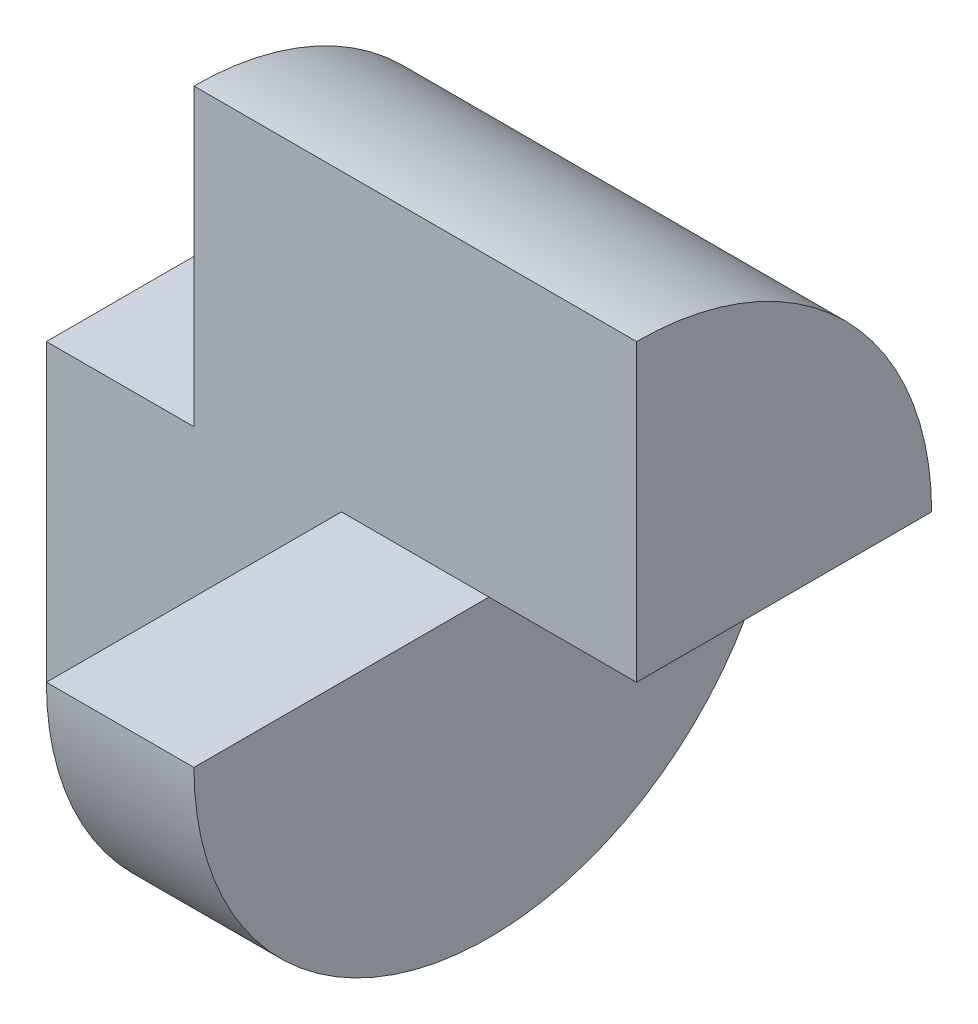
ISO-10303-21;
HEADER;
FILE_DESCRIPTION(('STEP AP214'),'2;1');
FILE_NAME('part.step','',(''),(''),'','','');
FILE_SCHEMA(('AUTOMOTIVE_DESIGN { 1 0 10303 214 1 1 1 1 }'));
ENDSEC;
DATA;
#1=APPLICATION_CONTEXT('core data for automotive mechanical design processes');
#2=APPLICATION_PROTOCOL_DEFINITION('international standard','automotive_design',2000,#1);
#3=PRODUCT_CONTEXT('',#1,'mechanical');
#4=PRODUCT('Part','Part','',(#3));
#5=PRODUCT_RELATED_PRODUCT_CATEGORY('part','',(#4));
#6=PRODUCT_DEFINITION_FORMATION('','',#4);
#7=PRODUCT_DEFINITION_CONTEXT('part definition',#1,'design');
#8=PRODUCT_DEFINITION('design','',#6,#7);
#9=PRODUCT_DEFINITION_SHAPE('','',#8);
#10=(LENGTH_UNIT() NAMED_UNIT(*) SI_UNIT(.MILLI.,.METRE.));
#11=(NAMED_UNIT(*) PLANE_ANGLE_UNIT() SI_UNIT($,.RADIAN.));
#12=(NAMED_UNIT(*) SI_UNIT($,.STERADIAN.) SOLID_ANGLE_UNIT());
#13=UNCERTAINTY_MEASURE_WITH_UNIT(LENGTH_MEASURE(1.E-05),#10,'distance_accuracy_value','');
#14=(GEOMETRIC_REPRESENTATION_CONTEXT(3) GLOBAL_UNCERTAINTY_ASSIGNED_CONTEXT((#13)) GLOBAL_UNIT_ASSIGNED_CONTEXT((#10,
#11,#12)) REPRESENTATION_CONTEXT('',''));
#15=CARTESIAN_POINT('',(0.,0.,0.));
#16=DIRECTION('',(0.,0.,1.));
#17=DIRECTION('',(1.,0.,0.));
#18=AXIS2_PLACEMENT_3D('',#15,#16,#17);
#19=CARTESIAN_POINT('',(0.,19.9999999999996,0.));
#20=DIRECTION('',(0.,-1.,0.));
#21=DIRECTION('',(0.,0.,-1.));
#22=AXIS2_PLACEMENT_3D('',#19,#20,#21);
#23=PLANE('',#22);
#24=DIRECTION('',(0.,0.,1.));
#25=VECTOR('',#24,1.);
#26=CARTESIAN_POINT('',(0.,19.9999999999996,0.));
#27=LINE('',#26,#25);
#28=CARTESIAN_POINT('',(0.,19.9999999999996,0.));
#29=VERTEX_POINT('',#28);
#30=CARTESIAN_POINT('',(0.,19.9999999999996,20.));
#31=VERTEX_POINT('',#30);
#32=EDGE_CURVE('E149',#29,#31,#27,.T.);
#33=ORIENTED_EDGE('',*,*,#32,.T.);
#34=DIRECTION('',(-1.,0.,0.));
#35=VECTOR('',#34,1.);
#36=CARTESIAN_POINT('',(20.,19.9999999999996,20.));
#37=LINE('',#36,#35);
#38=CARTESIAN_POINT('',(10.,19.9999999999996,20.));
#39=VERTEX_POINT('',#38);
#40=EDGE_CURVE('E157',#39,#31,#37,.T.);
#41=ORIENTED_EDGE('',*,*,#40,.F.);
#42=DIRECTION('',(0.,0.,1.));
#43=VECTOR('',#42,1.);
#44=CARTESIAN_POINT('',(10.,19.9999999999996,0.));
#45=LINE('',#44,#43);
#46=CARTESIAN_POINT('',(10.,19.9999999999996,-4.26741975090295E-13));
#47=VERTEX_POINT('',#46);
#48=EDGE_CURVE('E59',#47,#39,#45,.T.);
#49=ORIENTED_EDGE('',*,*,#48,.F.);
#50=DIRECTION('',(1.,0.,0.));
#51=VECTOR('',#50,1.);
#52=CARTESIAN_POINT('',(0.,19.9999999999996,0.));
#53=LINE('',#52,#51);
#54=EDGE_CURVE('E147',#29,#47,#53,.T.);
#55=ORIENTED_EDGE('',*,*,#54,.F.);
#56=EDGE_LOOP('',(#33,#41,#49,#55));
#57=FACE_BOUND('',#56,.T.);
#58=ADVANCED_FACE('F51',(#57),#23,.F.);
#59=CARTESIAN_POINT('',(0.,0.,40.));
#60=DIRECTION('',(1.,0.,0.));
#61=DIRECTION('',(0.,0.,-1.));
#62=AXIS2_PLACEMENT_3D('',#59,#60,#61);
#63=PLANE('',#62);
#64=CARTESIAN_POINT('',(0.,19.9999999999996,20.));
#65=DIRECTION('',(-1.,0.,0.));
#66=DIRECTION('',(0.,0.,1.));
#67=AXIS2_PLACEMENT_3D('',#64,#65,#66);
#68=CIRCLE('',#67,20.);
#69=CARTESIAN_POINT('',(0.,-4.26741975090295E-13,20.));
#70=VERTEX_POINT('',#69);
#71=EDGE_CURVE('E162',#70,#29,#68,.F.);
#72=ORIENTED_EDGE('',*,*,#71,.F.);
#73=DIRECTION('',(0.,-1.,0.));
#74=VECTOR('',#73,1.);
#75=CARTESIAN_POINT('',(0.,-4.26741975090295E-13,20.));
#76=LINE('',#75,#74);
#77=EDGE_CURVE('E122',#31,#70,#76,.T.);
#78=ORIENTED_EDGE('',*,*,#77,.F.);
#79=ORIENTED_EDGE('',*,*,#32,.F.);
#80=EDGE_LOOP('',(#72,#78,#79));
#81=FACE_BOUND('',#80,.T.);
#82=ADVANCED_FACE('F53',(#81),#63,.F.);
#83=CARTESIAN_POINT('',(40.,0.,40.));
#84=DIRECTION('',(-1.,0.,0.));
#85=DIRECTION('',(0.,0.,1.));
#86=AXIS2_PLACEMENT_3D('',#83,#84,#85);
#87=PLANE('',#86);
#88=DIRECTION('',(0.,0.,1.));
#89=VECTOR('',#88,1.);
#90=CARTESIAN_POINT('',(40.,20.,0.));
#91=LINE('',#90,#89);
#92=CARTESIAN_POINT('',(40.,19.9999999999996,-4.26741975090295E-13));
#93=VERTEX_POINT('',#92);
#94=CARTESIAN_POINT('',(40.,19.9999999999996,20.));
#95=VERTEX_POINT('',#94);
#96=EDGE_CURVE('E140',#93,#95,#91,.T.);
#97=ORIENTED_EDGE('',*,*,#96,.F.);
#98=CARTESIAN_POINT('',(40.,19.9999999999996,20.));
#99=DIRECTION('',(-1.,0.,0.));
#100=DIRECTION('',(0.,0.,1.));
#101=AXIS2_PLACEMENT_3D('',#98,#99,#100);
#102=CIRCLE('',#101,20.0000000000004);
#103=CARTESIAN_POINT('',(40.,40.,20.));
#104=VERTEX_POINT('',#103);
#105=EDGE_CURVE('E172',#93,#104,#102,.F.);
#106=ORIENTED_EDGE('',*,*,#105,.T.);
#107=DIRECTION('',(0.,-1.,0.));
#108=VECTOR('',#107,1.);
#109=CARTESIAN_POINT('',(40.,0.,20.));
#110=LINE('',#109,#108);
#111=EDGE_CURVE('E127',#104,#95,#110,.T.);
#112=ORIENTED_EDGE('',*,*,#111,.T.);
#113=EDGE_LOOP('',(#97,#106,#112));
#114=FACE_BOUND('',#113,.T.);
#115=ADVANCED_FACE('F190',(#114),#87,.F.);
#116=CARTESIAN_POINT('',(10.,40.,0.));
#117=DIRECTION('',(1.,0.,0.));
#118=DIRECTION('',(0.,1.,0.));
#119=AXIS2_PLACEMENT_3D('',#116,#117,#118);
#120=PLANE('',#119);
#121=DIRECTION('',(0.,-1.,0.));
#122=VECTOR('',#121,1.);
#123=CARTESIAN_POINT('',(10.,40.,20.));
#124=LINE('',#123,#122);
#125=CARTESIAN_POINT('',(10.,40.,20.));
#126=VERTEX_POINT('',#125);
#127=EDGE_CURVE('E133',#126,#39,#124,.T.);
#128=ORIENTED_EDGE('',*,*,#127,.F.);
#129=CARTESIAN_POINT('',(10.,19.9999999999996,20.));
#130=DIRECTION('',(1.,0.,0.));
#131=DIRECTION('',(0.,-1.,0.));
#132=AXIS2_PLACEMENT_3D('',#129,#130,#131);
#133=CIRCLE('',#132,20.0000000000004);
#134=EDGE_CURVE('E171',#47,#126,#133,.T.);
#135=ORIENTED_EDGE('',*,*,#134,.F.);
#136=ORIENTED_EDGE('',*,*,#48,.T.);
#137=EDGE_LOOP('',(#128,#135,#136));
#138=FACE_BOUND('',#137,.T.);
#139=ADVANCED_FACE('F180',(#138),#120,.F.);
#140=DIRECTION('',(-1.,0.,0.));
#141=VECTOR('',#140,1.);
#142=CARTESIAN_POINT('',(50.,19.9999999999996,20.));
#143=LINE('',#142,#141);
#144=CARTESIAN_POINT('',(30.,20.,20.));
#145=VERTEX_POINT('',#144);
#146=CARTESIAN_POINT('',(20.,19.9999999999996,20.));
#147=VERTEX_POINT('',#146);
#148=EDGE_CURVE('E73',#145,#147,#143,.T.);
#149=ORIENTED_EDGE('',*,*,#148,.T.);
#150=DIRECTION('',(0.,0.,-1.));
#151=VECTOR('',#150,1.);
#152=CARTESIAN_POINT('',(20.,19.9999999999996,20.));
#153=LINE('',#152,#151);
#154=CARTESIAN_POINT('',(20.,19.9999999999996,40.));
#155=VERTEX_POINT('',#154);
#156=EDGE_CURVE('E116',#155,#147,#153,.T.);
#157=ORIENTED_EDGE('',*,*,#156,.F.);
#158=DIRECTION('',(1.,0.,0.));
#159=VECTOR('',#158,1.);
#160=CARTESIAN_POINT('',(0.,19.9999999999996,40.));
#161=LINE('',#160,#159);
#162=CARTESIAN_POINT('',(30.,19.9999999999996,40.));
#163=VERTEX_POINT('',#162);
#164=EDGE_CURVE('E144',#155,#163,#161,.T.);
#165=ORIENTED_EDGE('',*,*,#164,.T.);
#166=DIRECTION('',(0.,0.,1.));
#167=VECTOR('',#166,1.);
#168=CARTESIAN_POINT('',(30.,20.,0.));
#169=LINE('',#168,#167);
#170=EDGE_CURVE('E126',#145,#163,#169,.T.);
#171=ORIENTED_EDGE('',*,*,#170,.F.);
#172=EDGE_LOOP('',(#149,#157,#165,#171));
#173=FACE_BOUND('',#172,.T.);
#174=ADVANCED_FACE('F124',(#173),#23,.F.);
#175=CARTESIAN_POINT('',(30.,0.,0.));
#176=DIRECTION('',(-1.,0.,0.));
#177=DIRECTION('',(0.,0.,1.));
#178=AXIS2_PLACEMENT_3D('',#175,#176,#177);
#179=PLANE('',#178);
#180=ORIENTED_EDGE('',*,*,#170,.T.);
#181=CARTESIAN_POINT('',(30.,19.9999999999996,20.));
#182=DIRECTION('',(-1.,0.,0.));
#183=DIRECTION('',(0.,0.,1.));
#184=AXIS2_PLACEMENT_3D('',#181,#182,#183);
#185=CIRCLE('',#184,20.);
#186=CARTESIAN_POINT('',(30.,19.9999999999996,0.));
#187=VERTEX_POINT('',#186);
#188=EDGE_CURVE('E169',#163,#187,#185,.F.);
#189=ORIENTED_EDGE('',*,*,#188,.T.);
#190=EDGE_CURVE('E141',#187,#145,#169,.T.);
#191=ORIENTED_EDGE('',*,*,#190,.T.);
#192=EDGE_LOOP('',(#180,#189,#191));
#193=FACE_BOUND('',#192,.T.);
#194=ADVANCED_FACE('F187',(#193),#179,.F.);
#195=CARTESIAN_POINT('',(40.,20.,0.));
#196=DIRECTION('',(0.,1.,0.));
#197=DIRECTION('',(-1.,0.,0.));
#198=AXIS2_PLACEMENT_3D('',#195,#196,#197);
#199=PLANE('',#198);
#200=ORIENTED_EDGE('',*,*,#96,.T.);
#201=DIRECTION('',(-1.,0.,0.));
#202=VECTOR('',#201,1.);
#203=CARTESIAN_POINT('',(40.,20.,20.));
#204=LINE('',#203,#202);
#205=EDGE_CURVE('E12',#95,#145,#204,.T.);
#206=ORIENTED_EDGE('',*,*,#205,.T.);
#207=ORIENTED_EDGE('',*,*,#190,.F.);
#208=DIRECTION('',(-1.,0.,0.));
#209=VECTOR('',#208,1.);
#210=CARTESIAN_POINT('',(40.,20.,0.));
#211=LINE('',#210,#209);
#212=EDGE_CURVE('E131',#93,#187,#211,.T.);
#213=ORIENTED_EDGE('',*,*,#212,.F.);
#214=EDGE_LOOP('',(#200,#206,#207,#213));
#215=FACE_BOUND('',#214,.T.);
#216=ADVANCED_FACE('F189',(#215),#199,.F.);
#217=CARTESIAN_POINT('',(50.,40.,20.));
#218=DIRECTION('',(0.,0.,-1.));
#219=DIRECTION('',(-1.,0.,0.));
#220=AXIS2_PLACEMENT_3D('',#217,#218,#219);
#221=PLANE('',#220);
#222=DIRECTION('',(-1.,0.,0.));
#223=VECTOR('',#222,1.);
#224=CARTESIAN_POINT('',(50.,40.,20.));
#225=LINE('',#224,#223);
#226=EDGE_CURVE('E128',#104,#126,#225,.T.);
#227=ORIENTED_EDGE('',*,*,#226,.T.);
#228=ORIENTED_EDGE('',*,*,#127,.T.);
#229=ORIENTED_EDGE('',*,*,#40,.T.);
#230=ORIENTED_EDGE('',*,*,#77,.T.);
#231=DIRECTION('',(-1.,0.,0.));
#232=VECTOR('',#231,1.);
#233=CARTESIAN_POINT('',(20.,-4.26741975090295E-13,20.));
#234=LINE('',#233,#232);
#235=CARTESIAN_POINT('',(20.,-8.53483950180589E-13,20.));
#236=VERTEX_POINT('',#235);
#237=EDGE_CURVE('E113',#236,#70,#234,.T.);
#238=ORIENTED_EDGE('',*,*,#237,.F.);
#239=DIRECTION('',(0.,-1.,0.));
#240=VECTOR('',#239,1.);
#241=CARTESIAN_POINT('',(20.,-4.26741975090295E-13,20.));
#242=LINE('',#241,#240);
#243=EDGE_CURVE('E66',#147,#236,#242,.T.);
#244=ORIENTED_EDGE('',*,*,#243,.F.);
#245=ORIENTED_EDGE('',*,*,#148,.F.);
#246=ORIENTED_EDGE('',*,*,#205,.F.);
#247=ORIENTED_EDGE('',*,*,#111,.F.);
#248=EDGE_LOOP('',(#227,#228,#229,#230,#238,#244,#245,#246,#247));
#249=FACE_BOUND('',#248,.T.);
#250=ADVANCED_FACE('F111',(#249),#221,.F.);
#251=CARTESIAN_POINT('',(50.,19.9999999999996,20.));
#252=DIRECTION('',(-1.,0.,0.));
#253=DIRECTION('',(0.,-1.,0.));
#254=AXIS2_PLACEMENT_3D('',#251,#252,#253);
#255=CYLINDRICAL_SURFACE('',#254,20.0000000000004);
#256=CARTESIAN_POINT('',(20.,19.9999999999996,20.));
#257=DIRECTION('',(-1.,0.,0.));
#258=DIRECTION('',(0.,0.,-1.));
#259=AXIS2_PLACEMENT_3D('',#256,#257,#258);
#260=CIRCLE('',#259,20.);
#261=EDGE_CURVE('E115',#236,#155,#260,.T.);
#262=ORIENTED_EDGE('',*,*,#261,.F.);
#263=ORIENTED_EDGE('',*,*,#237,.T.);
#264=ORIENTED_EDGE('',*,*,#71,.T.);
#265=ORIENTED_EDGE('',*,*,#54,.T.);
#266=ORIENTED_EDGE('',*,*,#134,.T.);
#267=ORIENTED_EDGE('',*,*,#226,.F.);
#268=ORIENTED_EDGE('',*,*,#105,.F.);
#269=ORIENTED_EDGE('',*,*,#212,.T.);
#270=ORIENTED_EDGE('',*,*,#188,.F.);
#271=ORIENTED_EDGE('',*,*,#164,.F.);
#272=EDGE_LOOP('',(#262,#263,#264,#265,#266,#267,#268,#269,#270,#271));
#273=FACE_BOUND('',#272,.T.);
#274=ADVANCED_FACE('F182',(#273),#255,.T.);
#275=CARTESIAN_POINT('',(20.,19.9999999999996,20.));
#276=DIRECTION('',(1.,0.,0.));
#277=DIRECTION('',(0.,0.,-1.));
#278=AXIS2_PLACEMENT_3D('',#275,#276,#277);
#279=PLANE('',#278);
#280=ORIENTED_EDGE('',*,*,#156,.T.);
#281=ORIENTED_EDGE('',*,*,#243,.T.);
#282=ORIENTED_EDGE('',*,*,#261,.T.);
#283=EDGE_LOOP('',(#280,#281,#282));
#284=FACE_BOUND('',#283,.T.);
#285=ADVANCED_FACE('F119',(#284),#279,.F.);
#286=CLOSED_SHELL('',(#58,#82,#115,#139,#174,#194,#216,#250,#274,#285));
#287=MANIFOLD_SOLID_BREP('B2',#286);
#288=ADVANCED_BREP_SHAPE_REPRESENTATION('',(#18,#287),#14);
#289=SHAPE_DEFINITION_REPRESENTATION(#9,#288);
ENDSEC;
END-ISO-10303-21;
